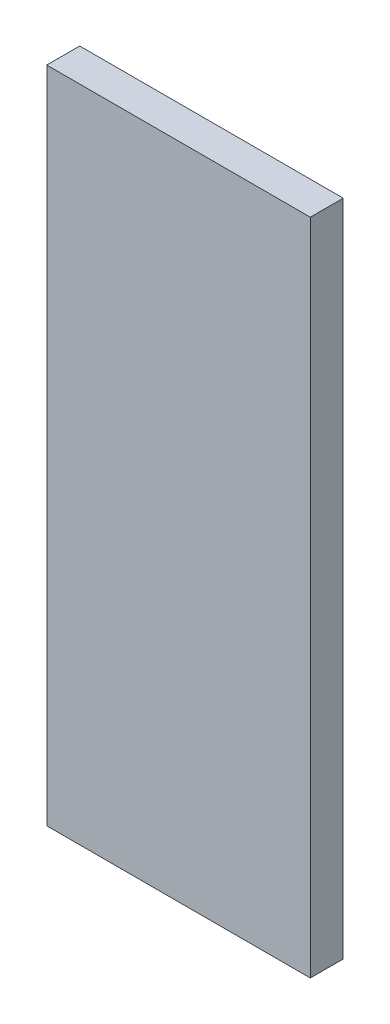
ISO-10303-21;
HEADER;
FILE_DESCRIPTION(('STEP AP214'),'2;1');
FILE_NAME('part.step','',(''),(''),'','','');
FILE_SCHEMA(('AUTOMOTIVE_DESIGN { 1 0 10303 214 1 1 1 1 }'));
ENDSEC;
DATA;
#1=APPLICATION_CONTEXT('core data for automotive mechanical design processes');
#2=APPLICATION_PROTOCOL_DEFINITION('international standard','automotive_design',2000,#1);
#3=PRODUCT_CONTEXT('',#1,'mechanical');
#4=PRODUCT('Part','Part','',(#3));
#5=PRODUCT_RELATED_PRODUCT_CATEGORY('part','',(#4));
#6=PRODUCT_DEFINITION_FORMATION('','',#4);
#7=PRODUCT_DEFINITION_CONTEXT('part definition',#1,'design');
#8=PRODUCT_DEFINITION('design','',#6,#7);
#9=PRODUCT_DEFINITION_SHAPE('','',#8);
#10=(LENGTH_UNIT() NAMED_UNIT(*) SI_UNIT(.MILLI.,.METRE.));
#11=(NAMED_UNIT(*) PLANE_ANGLE_UNIT() SI_UNIT($,.RADIAN.));
#12=(NAMED_UNIT(*) SI_UNIT($,.STERADIAN.) SOLID_ANGLE_UNIT());
#13=UNCERTAINTY_MEASURE_WITH_UNIT(LENGTH_MEASURE(1.E-05),#10,'distance_accuracy_value','');
#14=(GEOMETRIC_REPRESENTATION_CONTEXT(3) GLOBAL_UNCERTAINTY_ASSIGNED_CONTEXT((#13)) GLOBAL_UNIT_ASSIGNED_CONTEXT((#10,
#11,#12)) REPRESENTATION_CONTEXT('',''));
#15=CARTESIAN_POINT('',(0.,0.,0.));
#16=DIRECTION('',(0.,0.,1.));
#17=DIRECTION('',(1.,0.,0.));
#18=AXIS2_PLACEMENT_3D('',#15,#16,#17);
#19=CARTESIAN_POINT('',(20.,0.,2.5));
#20=DIRECTION('',(0.,1.,0.));
#21=DIRECTION('',(0.,0.,1.));
#22=AXIS2_PLACEMENT_3D('',#19,#20,#21);
#23=PLANE('',#22);
#24=DIRECTION('',(1.,0.,0.));
#25=VECTOR('',#24,1.);
#26=CARTESIAN_POINT('',(20.,0.,0.));
#27=LINE('',#26,#25);
#28=CARTESIAN_POINT('',(0.,0.,0.));
#29=VERTEX_POINT('',#28);
#30=CARTESIAN_POINT('',(20.,0.,0.));
#31=VERTEX_POINT('',#30);
#32=EDGE_CURVE('E102',#29,#31,#27,.T.);
#33=ORIENTED_EDGE('',*,*,#32,.T.);
#34=DIRECTION('',(0.,0.,-1.));
#35=VECTOR('',#34,1.);
#36=CARTESIAN_POINT('',(20.,0.,2.5));
#37=LINE('',#36,#35);
#38=CARTESIAN_POINT('',(20.,0.,2.5));
#39=VERTEX_POINT('',#38);
#40=EDGE_CURVE('E11',#39,#31,#37,.T.);
#41=ORIENTED_EDGE('',*,*,#40,.F.);
#42=DIRECTION('',(1.,0.,0.));
#43=VECTOR('',#42,1.);
#44=CARTESIAN_POINT('',(20.,0.,2.5));
#45=LINE('',#44,#43);
#46=CARTESIAN_POINT('',(0.,0.,2.5));
#47=VERTEX_POINT('',#46);
#48=EDGE_CURVE('E90',#47,#39,#45,.T.);
#49=ORIENTED_EDGE('',*,*,#48,.F.);
#50=DIRECTION('',(0.,0.,-1.));
#51=VECTOR('',#50,1.);
#52=CARTESIAN_POINT('',(0.,0.,2.5));
#53=LINE('',#52,#51);
#54=EDGE_CURVE('E98',#47,#29,#53,.T.);
#55=ORIENTED_EDGE('',*,*,#54,.T.);
#56=EDGE_LOOP('',(#33,#41,#49,#55));
#57=FACE_BOUND('',#56,.T.);
#58=ADVANCED_FACE('F39',(#57),#23,.F.);
#59=CARTESIAN_POINT('',(20.,50.,2.5));
#60=DIRECTION('',(-1.,0.,0.));
#61=DIRECTION('',(0.,0.,1.));
#62=AXIS2_PLACEMENT_3D('',#59,#60,#61);
#63=PLANE('',#62);
#64=DIRECTION('',(0.,1.,0.));
#65=VECTOR('',#64,1.);
#66=CARTESIAN_POINT('',(20.,50.,0.));
#67=LINE('',#66,#65);
#68=CARTESIAN_POINT('',(20.,50.,0.));
#69=VERTEX_POINT('',#68);
#70=EDGE_CURVE('E94',#31,#69,#67,.T.);
#71=ORIENTED_EDGE('',*,*,#70,.T.);
#72=DIRECTION('',(0.,0.,-1.));
#73=VECTOR('',#72,1.);
#74=CARTESIAN_POINT('',(20.,50.,2.5));
#75=LINE('',#74,#73);
#76=CARTESIAN_POINT('',(20.,50.,2.5));
#77=VERTEX_POINT('',#76);
#78=EDGE_CURVE('E47',#77,#69,#75,.T.);
#79=ORIENTED_EDGE('',*,*,#78,.F.);
#80=DIRECTION('',(0.,1.,0.));
#81=VECTOR('',#80,1.);
#82=CARTESIAN_POINT('',(20.,50.,2.5));
#83=LINE('',#82,#81);
#84=EDGE_CURVE('E85',#39,#77,#83,.T.);
#85=ORIENTED_EDGE('',*,*,#84,.F.);
#86=ORIENTED_EDGE('',*,*,#40,.T.);
#87=EDGE_LOOP('',(#71,#79,#85,#86));
#88=FACE_BOUND('',#87,.T.);
#89=ADVANCED_FACE('F93',(#88),#63,.F.);
#90=CARTESIAN_POINT('',(0.,50.,2.5));
#91=DIRECTION('',(0.,-1.,0.));
#92=DIRECTION('',(0.,0.,-1.));
#93=AXIS2_PLACEMENT_3D('',#90,#91,#92);
#94=PLANE('',#93);
#95=DIRECTION('',(-1.,0.,0.));
#96=VECTOR('',#95,1.);
#97=CARTESIAN_POINT('',(0.,50.,0.));
#98=LINE('',#97,#96);
#99=CARTESIAN_POINT('',(0.,50.,0.));
#100=VERTEX_POINT('',#99);
#101=EDGE_CURVE('E72',#69,#100,#98,.T.);
#102=ORIENTED_EDGE('',*,*,#101,.T.);
#103=DIRECTION('',(0.,0.,-1.));
#104=VECTOR('',#103,1.);
#105=CARTESIAN_POINT('',(0.,50.,2.5));
#106=LINE('',#105,#104);
#107=CARTESIAN_POINT('',(0.,50.,2.5));
#108=VERTEX_POINT('',#107);
#109=EDGE_CURVE('E95',#108,#100,#106,.T.);
#110=ORIENTED_EDGE('',*,*,#109,.F.);
#111=DIRECTION('',(-1.,0.,0.));
#112=VECTOR('',#111,1.);
#113=CARTESIAN_POINT('',(0.,50.,2.5));
#114=LINE('',#113,#112);
#115=EDGE_CURVE('E88',#77,#108,#114,.T.);
#116=ORIENTED_EDGE('',*,*,#115,.F.);
#117=ORIENTED_EDGE('',*,*,#78,.T.);
#118=EDGE_LOOP('',(#102,#110,#116,#117));
#119=FACE_BOUND('',#118,.T.);
#120=ADVANCED_FACE('F96',(#119),#94,.F.);
#121=CARTESIAN_POINT('',(0.,0.,2.5));
#122=DIRECTION('',(1.,0.,0.));
#123=DIRECTION('',(0.,0.,-1.));
#124=AXIS2_PLACEMENT_3D('',#121,#122,#123);
#125=PLANE('',#124);
#126=DIRECTION('',(0.,-1.,0.));
#127=VECTOR('',#126,1.);
#128=CARTESIAN_POINT('',(0.,0.,0.));
#129=LINE('',#128,#127);
#130=EDGE_CURVE('E78',#100,#29,#129,.T.);
#131=ORIENTED_EDGE('',*,*,#130,.T.);
#132=ORIENTED_EDGE('',*,*,#54,.F.);
#133=DIRECTION('',(0.,-1.,0.));
#134=VECTOR('',#133,1.);
#135=CARTESIAN_POINT('',(0.,0.,2.5));
#136=LINE('',#135,#134);
#137=EDGE_CURVE('E55',#108,#47,#136,.T.);
#138=ORIENTED_EDGE('',*,*,#137,.F.);
#139=ORIENTED_EDGE('',*,*,#109,.T.);
#140=EDGE_LOOP('',(#131,#132,#138,#139));
#141=FACE_BOUND('',#140,.T.);
#142=ADVANCED_FACE('F109',(#141),#125,.F.);
#143=CARTESIAN_POINT('',(0.,0.,2.5));
#144=DIRECTION('',(0.,0.,-1.));
#145=DIRECTION('',(-1.,0.,0.));
#146=AXIS2_PLACEMENT_3D('',#143,#144,#145);
#147=PLANE('',#146);
#148=ORIENTED_EDGE('',*,*,#48,.T.);
#149=ORIENTED_EDGE('',*,*,#84,.T.);
#150=ORIENTED_EDGE('',*,*,#115,.T.);
#151=ORIENTED_EDGE('',*,*,#137,.T.);
#152=EDGE_LOOP('',(#148,#149,#150,#151));
#153=FACE_BOUND('',#152,.T.);
#154=ADVANCED_FACE('F86',(#153),#147,.F.);
#155=CARTESIAN_POINT('',(0.,0.,0.));
#156=DIRECTION('',(0.,0.,-1.));
#157=DIRECTION('',(-1.,0.,0.));
#158=AXIS2_PLACEMENT_3D('',#155,#156,#157);
#159=PLANE('',#158);
#160=ORIENTED_EDGE('',*,*,#32,.F.);
#161=ORIENTED_EDGE('',*,*,#130,.F.);
#162=ORIENTED_EDGE('',*,*,#101,.F.);
#163=ORIENTED_EDGE('',*,*,#70,.F.);
#164=EDGE_LOOP('',(#160,#161,#162,#163));
#165=FACE_BOUND('',#164,.T.);
#166=ADVANCED_FACE('F112',(#165),#159,.T.);
#167=CLOSED_SHELL('',(#58,#89,#120,#142,#154,#166));
#168=MANIFOLD_SOLID_BREP('B2',#167);
#169=ADVANCED_BREP_SHAPE_REPRESENTATION('',(#18,#168),#14);
#170=SHAPE_DEFINITION_REPRESENTATION(#9,#169);
ENDSEC;
END-ISO-10303-21;
